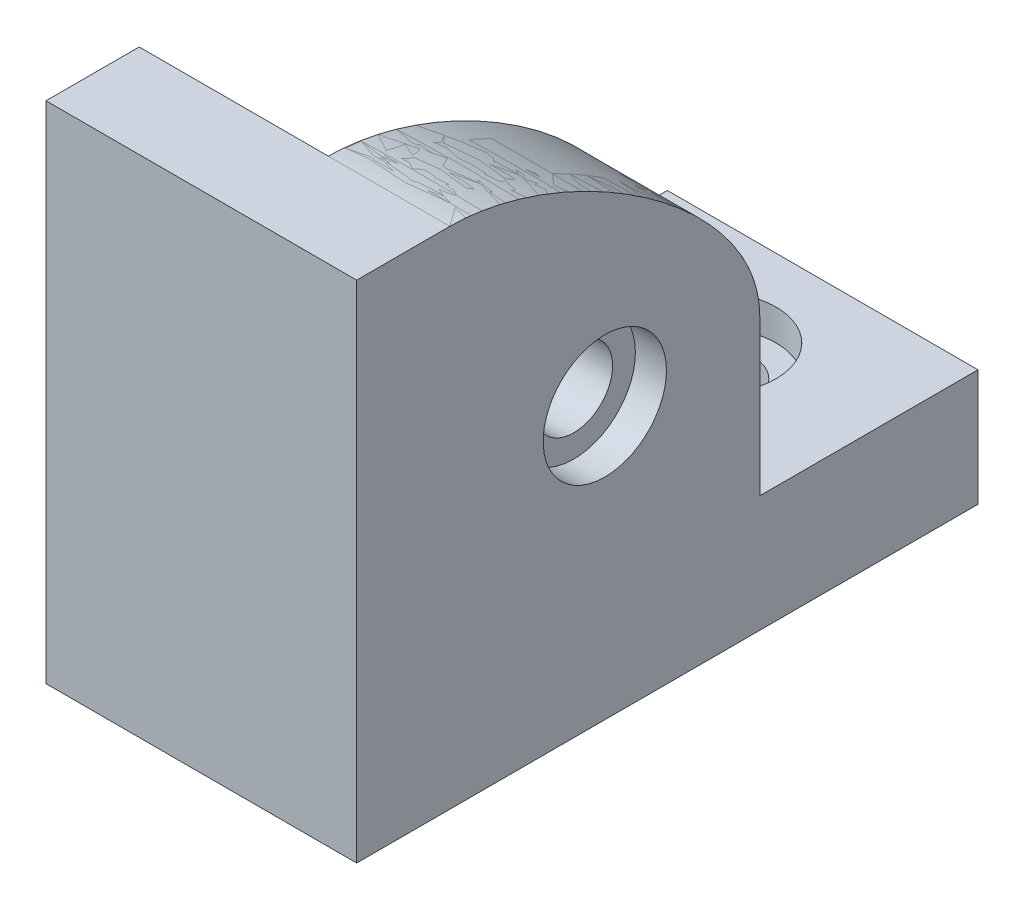
ISO-10303-21;
HEADER;
FILE_DESCRIPTION(('STEP AP214'),'2;1');
FILE_NAME('part.step','',(''),(''),'','','');
FILE_SCHEMA(('AUTOMOTIVE_DESIGN { 1 0 10303 214 1 1 1 1 }'));
ENDSEC;
DATA;
#1=APPLICATION_CONTEXT('core data for automotive mechanical design processes');
#2=APPLICATION_PROTOCOL_DEFINITION('international standard','automotive_design',2000,#1);
#3=PRODUCT_CONTEXT('',#1,'mechanical');
#4=PRODUCT('Part','Part','',(#3));
#5=PRODUCT_RELATED_PRODUCT_CATEGORY('part','',(#4));
#6=PRODUCT_DEFINITION_FORMATION('','',#4);
#7=PRODUCT_DEFINITION_CONTEXT('part definition',#1,'design');
#8=PRODUCT_DEFINITION('design','',#6,#7);
#9=PRODUCT_DEFINITION_SHAPE('','',#8);
#10=(LENGTH_UNIT() NAMED_UNIT(*) SI_UNIT(.MILLI.,.METRE.));
#11=(NAMED_UNIT(*) PLANE_ANGLE_UNIT() SI_UNIT($,.RADIAN.));
#12=(NAMED_UNIT(*) SI_UNIT($,.STERADIAN.) SOLID_ANGLE_UNIT());
#13=UNCERTAINTY_MEASURE_WITH_UNIT(LENGTH_MEASURE(1.E-05),#10,'distance_accuracy_value','');
#14=(GEOMETRIC_REPRESENTATION_CONTEXT(3) GLOBAL_UNCERTAINTY_ASSIGNED_CONTEXT((#13)) GLOBAL_UNIT_ASSIGNED_CONTEXT((#10,
#11,#12)) REPRESENTATION_CONTEXT('',''));
#15=CARTESIAN_POINT('',(0.,0.,0.));
#16=DIRECTION('',(0.,0.,1.));
#17=DIRECTION('',(1.,0.,0.));
#18=AXIS2_PLACEMENT_3D('',#15,#16,#17);
#19=CARTESIAN_POINT('',(5.46874999999998,17.5,-11.4203460586659));
#20=CARTESIAN_POINT('',(5.46874999999998,24.4922587484551,-11.4203460586659));
#21=CARTESIAN_POINT('',(5.46874999999998,32.5,0.878778443722737));
#22=CARTESIAN_POINT('',(5.46874999999998,32.5,8.53125000000001));
#23=CARTESIAN_POINT('',(4.80208333333332,17.5,-11.4203460586659));
#24=CARTESIAN_POINT('',(4.80208333333332,24.4922603521849,-11.4203460586659));
#25=CARTESIAN_POINT('',(4.81736452311698,32.5,0.878776839992983));
#26=CARTESIAN_POINT('',(4.81736452311697,32.5,8.53125000000001));
#27=CARTESIAN_POINT('',(3.46874999999998,17.5,-11.4203460586659));
#28=CARTESIAN_POINT('',(3.46874999999998,24.4922635596444,-11.4203460586659));
#29=CARTESIAN_POINT('',(3.51459356935097,32.5,0.878773632533474));
#30=CARTESIAN_POINT('',(3.51459356935096,32.5,8.53125000000001));
#31=CARTESIAN_POINT('',(1.46874999999998,17.5,-11.4203460586659));
#32=CARTESIAN_POINT('',(1.46874999999998,24.4922900210575,-11.4203460586659));
#33=CARTESIAN_POINT('',(1.56043713870191,32.5,0.87874717112037));
#34=CARTESIAN_POINT('',(1.56043713870194,32.5,8.53125));
#35=CARTESIAN_POINT('',(-0.531250000000016,17.5,-11.4203460586659));
#36=CARTESIAN_POINT('',(-0.531250000000016,24.4923309157828,-11.4203460586659));
#37=CARTESIAN_POINT('',(-0.393719291947067,32.5,0.878706276395059));
#38=CARTESIAN_POINT('',(-0.393719291947075,32.5,8.53125000000001));
#39=CARTESIAN_POINT('',(-1.86458333333335,17.5,-11.4203460586659));
#40=CARTESIAN_POINT('',(-1.86458333333335,24.492372611734,-11.4203460586659));
#41=CARTESIAN_POINT('',(-1.69649024571308,32.5,0.878664580443857));
#42=CARTESIAN_POINT('',(-1.69649024571309,32.5,8.53125000000001));
#43=CARTESIAN_POINT('',(-2.53125000000002,17.5,-11.4203460586659));
#44=CARTESIAN_POINT('',(-2.53125000000002,24.4923934597096,-11.4203460586659));
#45=CARTESIAN_POINT('',(-2.34787572259609,32.5,0.878643732468255));
#46=CARTESIAN_POINT('',(-2.34787572259609,32.5,8.53125000000001));
#47=B_SPLINE_SURFACE_WITH_KNOTS('',3,3,((#19,#20,#21,#22),(#23,#24,#25,#26),(#27,#28,#29,#30),
(#31,#32,#33,#34),(#35,#36,#37,#38),(#39,#40,#41,#42),(#43,#44,#45,#46)),.UNSPECIFIED.,.F.,.F.,
.F.,(4,1,1,1,4),(4,4),(0.,0.25,0.5,0.75,1.),(0.,1.),.UNSPECIFIED.);
#48=DIRECTION('',(-1.,0.,0.));
#49=VECTOR('',#48,1.);
#50=CARTESIAN_POINT('',(1.46874999999998,17.5,-11.4203460586659));
#51=LINE('',#50,#49);
#52=CARTESIAN_POINT('',(5.46874999999998,17.5,-11.4203460586659));
#53=VERTEX_POINT('',#52);
#54=CARTESIAN_POINT('',(-2.53125000000002,17.5,-11.4203460586659));
#55=VERTEX_POINT('',#54);
#56=EDGE_CURVE('E13',#53,#55,#51,.T.);
#57=CARTESIAN_POINT('',(-2.53125000000002,17.5,-11.4203460586659));
#58=CARTESIAN_POINT('',(-2.53125000000002,24.4923934597096,-11.4203460586659));
#59=CARTESIAN_POINT('',(-2.34787572259609,32.5,0.878643732468255));
#60=CARTESIAN_POINT('',(-2.34787572259609,32.5,8.53125000000001));
#61=B_SPLINE_CURVE_WITH_KNOTS('',3,(#57,#58,#59,#60),.UNSPECIFIED.,.F.,.F.,(4,4),(0.,1.),.UNSPECIFIED.);
#62=CARTESIAN_POINT('',(-2.34787572259609,32.5,8.53125000000001));
#63=VERTEX_POINT('',#62);
#64=EDGE_CURVE('E118',#55,#63,#61,.T.);
#65=DIRECTION('',(-1.,0.,0.));
#66=VECTOR('',#65,1.);
#67=CARTESIAN_POINT('',(1.56043713870194,32.5,8.53125));
#68=LINE('',#67,#66);
#69=CARTESIAN_POINT('',(5.46874999999998,32.5,8.53125000000001));
#70=VERTEX_POINT('',#69);
#71=EDGE_CURVE('E112',#70,#63,#68,.T.);
#72=CARTESIAN_POINT('',(5.46874999999998,17.5,-11.4203460586659));
#73=CARTESIAN_POINT('',(5.46874999999998,24.4922587484551,-11.4203460586659));
#74=CARTESIAN_POINT('',(5.46874999999998,32.5,0.878778443722737));
#75=CARTESIAN_POINT('',(5.46874999999998,32.5,8.53125000000001));
#76=B_SPLINE_CURVE_WITH_KNOTS('',3,(#72,#73,#74,#75),.UNSPECIFIED.,.F.,.F.,(4,4),(0.,1.),.UNSPECIFIED.);
#77=EDGE_CURVE('E131',#53,#70,#76,.T.);
#78=ORIENTED_EDGE('',*,*,#56,.T.);
#79=ORIENTED_EDGE('',*,*,#64,.T.);
#80=ORIENTED_EDGE('',*,*,#71,.F.);
#81=ORIENTED_EDGE('',*,*,#77,.F.);
#82=EDGE_LOOP('',(#78,#79,#80,#81));
#83=FACE_BOUND('',#82,.T.);
#84=ADVANCED_FACE('F109',(#83),#47,.T.);
#85=OPEN_SHELL('',(#84));
#86=SHELL_BASED_SURFACE_MODEL('B2',(#85));
#87=CARTESIAN_POINT('',(7.46874999999998,17.5,-1.44454802933295));
#88=DIRECTION('',(-1.,0.,0.));
#89=DIRECTION('',(0.,0.,1.));
#90=AXIS2_PLACEMENT_3D('',#87,#88,#89);
#91=CYLINDRICAL_SURFACE('',#90,2.5);
#92=CARTESIAN_POINT('',(-2.53125000000002,17.5,-1.44454802933295));
#93=DIRECTION('',(-1.,0.,0.));
#94=DIRECTION('',(0.,0.,1.));
#95=AXIS2_PLACEMENT_3D('',#92,#93,#94);
#96=CIRCLE('',#95,2.5);
#97=CARTESIAN_POINT('',(-2.53125000000002,17.5,-3.94454802933295));
#98=VERTEX_POINT('',#97);
#99=CARTESIAN_POINT('',(-2.53125000000002,17.5,1.05545197066705));
#100=VERTEX_POINT('',#99);
#101=EDGE_CURVE('E189',#98,#100,#96,.T.);
#102=ORIENTED_EDGE('',*,*,#101,.T.);
#103=CARTESIAN_POINT('',(-2.53125000000002,17.5,-3.94454802933295));
#104=CARTESIAN_POINT('',(-2.53072860302079,17.5703168114299,-3.94455476533739));
#105=CARTESIAN_POINT('',(-2.53020266211358,17.6406303926544,-3.94158138086595));
#106=CARTESIAN_POINT('',(-2.52914363108943,17.7807544209254,-3.92972651991399));
#107=CARTESIAN_POINT('',(-2.52861054131617,17.8505648919129,-3.92084532646593));
#108=CARTESIAN_POINT('',(-2.52753947737424,17.9891441455059,-3.89723528635993));
#109=CARTESIAN_POINT('',(-2.52700150690149,18.0579136257029,-3.8825105536597));
#110=CARTESIAN_POINT('',(-2.52592306686837,18.1939508371622,-3.84733290251047));
#111=CARTESIAN_POINT('',(-2.52538259733843,18.261218586649,-3.82688005361656));
#112=CARTESIAN_POINT('',(-2.52376114645402,18.4601179771052,-3.75709529449122));
#113=CARTESIAN_POINT('',(-2.52267967075456,18.5889044584542,-3.69932711781762));
#114=CARTESIAN_POINT('',(-2.52054714773739,18.8348534618292,-3.56302831265839));
#115=CARTESIAN_POINT('',(-2.51949609448815,18.9520182607176,-3.48450176214335));
#116=CARTESIAN_POINT('',(-2.51745770773856,19.1715244182749,-3.30888438973982));
#117=CARTESIAN_POINT('',(-2.5164703755734,19.2738654663903,-3.21179317902578));
#118=CARTESIAN_POINT('',(-2.51459688634019,19.4608050674248,-3.00179321737231));
#119=CARTESIAN_POINT('',(-2.5137107446932,19.5454009176826,-2.88888206135653));
#120=CARTESIAN_POINT('',(-2.51207783702964,19.6944302665532,-2.6504652173711));
#121=CARTESIAN_POINT('',(-2.51133106200813,19.7588650680183,-2.52496034392831));
#122=CARTESIAN_POINT('',(-2.51001289402045,19.8657445814045,-2.26492123408137));
#123=CARTESIAN_POINT('',(-2.50944148980044,19.9081907044945,-2.13038757774416));
#124=CARTESIAN_POINT('',(-2.50850549665141,19.9698946809412,-1.85610675518429));
#125=CARTESIAN_POINT('',(-2.50814090383561,19.9891529700929,-1.71635968699402));
#126=CARTESIAN_POINT('',(-2.50764328937251,20.0039321189962,-1.43560761947645));
#127=CARTESIAN_POINT('',(-2.50751027299217,19.9994524388617,-1.29460259161147));
#128=CARTESIAN_POINT('',(-2.50749183982671,19.9668959136227,-1.01536995638766));
#129=CARTESIAN_POINT('',(-2.50760641103917,19.9388202124347,-0.877142214720806));
#130=CARTESIAN_POINT('',(-2.50808977343197,19.8598195561542,-0.607298593889331));
#131=CARTESIAN_POINT('',(-2.50845856377565,19.8088946762603,-0.475682692966207));
#132=CARTESIAN_POINT('',(-2.50919793457815,19.7165657447936,-0.286187091936605));
#133=CARTESIAN_POINT('',(-2.50947561152868,19.6831113699531,-0.224313745568576));
#134=CARTESIAN_POINT('',(-2.51009147366542,19.6111120231501,-0.103601832609836));
#135=CARTESIAN_POINT('',(-2.51042964483067,19.5725682313203,-0.0447625668621468));
#136=CARTESIAN_POINT('',(-2.51116414901237,19.4906766124489,0.0694340589957167));
#137=CARTESIAN_POINT('',(-2.51156045779159,19.4473307891799,0.124792856419113));
#138=CARTESIAN_POINT('',(-2.51240864130402,19.3561027179078,0.231707112213782));
#139=CARTESIAN_POINT('',(-2.51286056928039,19.3082161333443,0.283258849447767));
#140=CARTESIAN_POINT('',(-2.51429377640519,19.1583423872952,0.431512669147167));
#141=CARTESIAN_POINT('',(-2.51535344645691,19.0500335367565,0.521963232033607));
#142=CARTESIAN_POINT('',(-2.5176454594551,18.8197563418269,0.683364484733246));
#143=CARTESIAN_POINT('',(-2.51887779592281,18.6977885099814,0.75431590589559));
#144=CARTESIAN_POINT('',(-2.52082227203037,18.507257864124,0.844644420869296));
#145=CARTESIAN_POINT('',(-2.52148718808901,18.4424111280201,0.872091517141277));
#146=CARTESIAN_POINT('',(-2.52284272518149,18.310671876923,0.921407857485457));
#147=CARTESIAN_POINT('',(-2.52353332487184,18.2437810684808,0.943281619421594));
#148=CARTESIAN_POINT('',(-2.52493346456916,18.1084666889405,0.981293062803098));
#149=CARTESIAN_POINT('',(-2.52564298531421,18.0400446872394,0.997436355027009));
#150=CARTESIAN_POINT('',(-2.52707491834826,17.9020969382961,1.02390230831038));
#151=CARTESIAN_POINT('',(-2.52779732679878,17.8325715203554,1.03422667358182));
#152=CARTESIAN_POINT('',(-2.52897636598023,17.719079100866,1.04622169804947));
#153=CARTESIAN_POINT('',(-2.52943118925927,17.675293668189,1.04968525300246));
#154=CARTESIAN_POINT('',(-2.53034081728835,17.5876736993652,1.05429871652356));
#155=CARTESIAN_POINT('',(-2.5307956208257,17.5438393640991,1.05545244095135));
#156=CARTESIAN_POINT('',(-2.53125000000002,17.5,1.0554519706676));
#157=B_SPLINE_CURVE_WITH_KNOTS('',3,(#103,#104,#105,#106,#107,#108,#109,#110,#111,#112,#113,
#114,#115,#116,#117,#118,#119,#120,#121,#122,#123,#124,#125,#126,#127,#128,#129,#130,#131,#132,
#133,#134,#135,#136,#137,#138,#139,#140,#141,#142,#143,#144,#145,#146,#147,#148,#149,#150,#151,
#152,#153,#154,#155,#156),.UNSPECIFIED.,.F.,.F.,(4,2,2,2,2,2,2,2,2,2,2,2,2,2,2,2,2,2,2,2,2,2,2,
2,2,2,4),(0.,0.210887626755834,0.421765150993223,0.632494476250965,0.843221242785776,
1.26449836183744,1.68569278266523,2.10689602612149,2.52816337393263,2.9494034928756,
3.3706165745107,3.79182173969187,4.21303648462138,4.63423081056959,5.05542375034402,
5.26623529610221,5.47699804450008,5.68767317557845,5.89855157387015,6.31976175806819,
6.74095614189066,6.9520049279565,7.16288208513938,7.3735521964798,7.58416057593354,
7.71587834108512,7.8473783272208),.UNSPECIFIED.);
#158=EDGE_CURVE('E107',#98,#100,#157,.T.);
#159=ORIENTED_EDGE('',*,*,#158,.F.);
#160=EDGE_LOOP('',(#102,#159));
#161=FACE_BOUND('',#160,.T.);
#162=CARTESIAN_POINT('',(3.46874999999998,17.5,-1.44454802933295));
#163=DIRECTION('',(1.,0.,0.));
#164=DIRECTION('',(0.,0.,-1.));
#165=AXIS2_PLACEMENT_3D('',#162,#163,#164);
#166=CIRCLE('',#165,2.5);
#167=CARTESIAN_POINT('',(3.46874999999998,17.5,-3.94454802933295));
#168=VERTEX_POINT('',#167);
#169=EDGE_CURVE('E177',#168,#168,#166,.F.);
#170=ORIENTED_EDGE('',*,*,#169,.F.);
#171=EDGE_LOOP('',(#170));
#172=FACE_BOUND('',#171,.T.);
#173=ADVANCED_FACE('F173',(#161,#172),#91,.F.);
#174=CARTESIAN_POINT('',(-4.53125000000002,-2.5,-18.46875));
#175=DIRECTION('',(0.,1.,0.));
#176=DIRECTION('',(0.,0.,1.));
#177=AXIS2_PLACEMENT_3D('',#174,#175,#176);
#178=CYLINDRICAL_SURFACE('',#177,2.5);
#179=CARTESIAN_POINT('',(-4.53125000000002,0.,-18.46875));
#180=DIRECTION('',(0.,1.,0.));
#181=DIRECTION('',(0.,0.,1.));
#182=AXIS2_PLACEMENT_3D('',#179,#180,#181);
#183=CIRCLE('',#182,2.5);
#184=CARTESIAN_POINT('',(-4.53125000000002,0.,-15.96875));
#185=VERTEX_POINT('',#184);
#186=EDGE_CURVE('E397',#185,#185,#183,.T.);
#187=ORIENTED_EDGE('',*,*,#186,.F.);
#188=EDGE_LOOP('',(#187));
#189=FACE_BOUND('',#188,.T.);
#190=CARTESIAN_POINT('',(-4.53125000000002,5.5,-18.46875));
#191=DIRECTION('',(0.,1.,0.));
#192=DIRECTION('',(0.,0.,1.));
#193=AXIS2_PLACEMENT_3D('',#190,#191,#192);
#194=CIRCLE('',#193,2.5);
#195=CARTESIAN_POINT('',(-4.53125000000002,5.5,-15.96875));
#196=VERTEX_POINT('',#195);
#197=EDGE_CURVE('E389',#196,#196,#194,.F.);
#198=ORIENTED_EDGE('',*,*,#197,.F.);
#199=EDGE_LOOP('',(#198));
#200=FACE_BOUND('',#199,.T.);
#201=ADVANCED_FACE('F338',(#189,#200),#178,.F.);
#202=CARTESIAN_POINT('',(-8.53125000000002,-2.5,0.));
#203=DIRECTION('',(0.,1.,0.));
#204=DIRECTION('',(0.,0.,1.));
#205=AXIS2_PLACEMENT_3D('',#202,#203,#204);
#206=CYLINDRICAL_SURFACE('',#205,2.5);
#207=CARTESIAN_POINT('',(-8.53125000000002,0.,0.));
#208=DIRECTION('',(0.,1.,0.));
#209=DIRECTION('',(0.,0.,1.));
#210=AXIS2_PLACEMENT_3D('',#207,#208,#209);
#211=CIRCLE('',#210,2.5);
#212=CARTESIAN_POINT('',(-8.53125000000002,0.,2.5));
#213=VERTEX_POINT('',#212);
#214=EDGE_CURVE('E258',#213,#213,#211,.T.);
#215=ORIENTED_EDGE('',*,*,#214,.F.);
#216=EDGE_LOOP('',(#215));
#217=FACE_BOUND('',#216,.T.);
#218=CARTESIAN_POINT('',(-8.53125000000002,5.5,0.));
#219=DIRECTION('',(0.,1.,0.));
#220=DIRECTION('',(0.,0.,1.));
#221=AXIS2_PLACEMENT_3D('',#218,#219,#220);
#222=CIRCLE('',#221,2.5);
#223=CARTESIAN_POINT('',(-8.53125000000002,5.5,2.5));
#224=VERTEX_POINT('',#223);
#225=EDGE_CURVE('E394',#224,#224,#222,.F.);
#226=ORIENTED_EDGE('',*,*,#225,.F.);
#227=EDGE_LOOP('',(#226));
#228=FACE_BOUND('',#227,.T.);
#229=ADVANCED_FACE('F339',(#217,#228),#206,.F.);
#230=CARTESIAN_POINT('',(0.,7.5,0.));
#231=DIRECTION('',(0.,1.,0.));
#232=DIRECTION('',(0.,0.,1.));
#233=AXIS2_PLACEMENT_3D('',#230,#231,#232);
#234=PLANE('',#233);
#235=CARTESIAN_POINT('',(-4.53125000000002,7.5,-18.46875));
#236=DIRECTION('',(0.,1.,0.));
#237=DIRECTION('',(0.,0.,1.));
#238=AXIS2_PLACEMENT_3D('',#235,#236,#237);
#239=CIRCLE('',#238,4.);
#240=CARTESIAN_POINT('',(-4.53125000000002,7.5,-14.46875));
#241=VERTEX_POINT('',#240);
#242=EDGE_CURVE('E379',#241,#241,#239,.T.);
#243=ORIENTED_EDGE('',*,*,#242,.F.);
#244=EDGE_LOOP('',(#243));
#245=FACE_BOUND('',#244,.T.);
#246=CARTESIAN_POINT('',(-8.53125000000002,7.5,0.));
#247=DIRECTION('',(0.,1.,0.));
#248=DIRECTION('',(0.,0.,1.));
#249=AXIS2_PLACEMENT_3D('',#246,#247,#248);
#250=CIRCLE('',#249,4.);
#251=CARTESIAN_POINT('',(-8.53125000000002,7.5,4.));
#252=VERTEX_POINT('',#251);
#253=EDGE_CURVE('E395',#252,#252,#250,.T.);
#254=ORIENTED_EDGE('',*,*,#253,.F.);
#255=EDGE_LOOP('',(#254));
#256=FACE_BOUND('',#255,.T.);
#257=DIRECTION('',(0.,0.,1.));
#258=VECTOR('',#257,1.);
#259=CARTESIAN_POINT('',(-2.53125000000002,7.5,8.57965394133409));
#260=LINE('',#259,#258);
#261=CARTESIAN_POINT('',(-2.53125000000002,7.5,-11.4203460586659));
#262=VERTEX_POINT('',#261);
#263=CARTESIAN_POINT('',(-2.53125000000002,7.5,8.53125000000001));
#264=VERTEX_POINT('',#263);
#265=EDGE_CURVE('E274',#262,#264,#260,.T.);
#266=ORIENTED_EDGE('',*,*,#265,.F.);
#267=DIRECTION('',(-1.,0.,0.));
#268=VECTOR('',#267,1.);
#269=CARTESIAN_POINT('',(5.46874999999998,7.5,-11.4203460586659));
#270=LINE('',#269,#268);
#271=CARTESIAN_POINT('',(5.46874999999998,7.5,-11.4203460586659));
#272=VERTEX_POINT('',#271);
#273=EDGE_CURVE('E272',#272,#262,#270,.T.);
#274=ORIENTED_EDGE('',*,*,#273,.F.);
#275=DIRECTION('',(0.,0.,-1.));
#276=VECTOR('',#275,1.);
#277=CARTESIAN_POINT('',(5.46874999999998,7.5,-25.46875));
#278=LINE('',#277,#276);
#279=CARTESIAN_POINT('',(5.46874999999998,7.5,-25.46875));
#280=VERTEX_POINT('',#279);
#281=EDGE_CURVE('E299',#272,#280,#278,.T.);
#282=ORIENTED_EDGE('',*,*,#281,.T.);
#283=DIRECTION('',(-1.,0.,0.));
#284=VECTOR('',#283,1.);
#285=CARTESIAN_POINT('',(-14.53125,7.5,-25.46875));
#286=LINE('',#285,#284);
#287=CARTESIAN_POINT('',(-14.53125,7.5,-25.46875));
#288=VERTEX_POINT('',#287);
#289=EDGE_CURVE('E302',#280,#288,#286,.T.);
#290=ORIENTED_EDGE('',*,*,#289,.T.);
#291=DIRECTION('',(0.,0.,1.));
#292=VECTOR('',#291,1.);
#293=CARTESIAN_POINT('',(-14.53125,7.5,-25.46875));
#294=LINE('',#293,#292);
#295=CARTESIAN_POINT('',(-14.53125,7.5,8.53125000000001));
#296=VERTEX_POINT('',#295);
#297=EDGE_CURVE('E296',#288,#296,#294,.T.);
#298=ORIENTED_EDGE('',*,*,#297,.T.);
#299=DIRECTION('',(-1.,0.,0.));
#300=VECTOR('',#299,1.);
#301=CARTESIAN_POINT('',(-14.53125,7.5,8.53125000000001));
#302=LINE('',#301,#300);
#303=EDGE_CURVE('E277',#264,#296,#302,.T.);
#304=ORIENTED_EDGE('',*,*,#303,.F.);
#305=EDGE_LOOP('',(#266,#274,#282,#290,#298,#304));
#306=FACE_BOUND('',#305,.T.);
#307=ADVANCED_FACE('F342',(#245,#256,#306),#234,.T.);
#308=CARTESIAN_POINT('',(-14.53125,32.5,8.53125000000001));
#309=DIRECTION('',(0.,0.,1.));
#310=DIRECTION('',(1.,0.,0.));
#311=AXIS2_PLACEMENT_3D('',#308,#309,#310);
#312=PLANE('',#311);
#313=DIRECTION('',(-1.,0.,0.));
#314=VECTOR('',#313,1.);
#315=CARTESIAN_POINT('',(-14.53125,32.5,8.53125000000001));
#316=LINE('',#315,#314);
#317=CARTESIAN_POINT('',(-2.34787572259609,32.5,8.53125));
#318=VERTEX_POINT('',#317);
#319=CARTESIAN_POINT('',(-14.53125,32.5,8.53125000000001));
#320=VERTEX_POINT('',#319);
#321=EDGE_CURVE('E287',#318,#320,#316,.T.);
#322=ORIENTED_EDGE('',*,*,#321,.F.);
#323=DIRECTION('',(-0.0122240384231617,-0.999925283651048,0.));
#324=VECTOR('',#323,1.);
#325=CARTESIAN_POINT('',(-2.43956286129806,25.,8.53125));
#326=LINE('',#325,#324);
#327=CARTESIAN_POINT('',(-2.53125000000002,17.5,8.53125000000001));
#328=VERTEX_POINT('',#327);
#329=EDGE_CURVE('E402',#318,#328,#326,.T.);
#330=ORIENTED_EDGE('',*,*,#329,.T.);
#331=DIRECTION('',(0.,1.,0.));
#332=VECTOR('',#331,1.);
#333=CARTESIAN_POINT('',(-2.53125000000002,32.5,8.53125000000001));
#334=LINE('',#333,#332);
#335=EDGE_CURVE('E182',#264,#328,#334,.T.);
#336=ORIENTED_EDGE('',*,*,#335,.F.);
#337=ORIENTED_EDGE('',*,*,#303,.T.);
#338=DIRECTION('',(0.,-1.,0.));
#339=VECTOR('',#338,1.);
#340=CARTESIAN_POINT('',(-14.53125,32.5,8.53125000000001));
#341=LINE('',#340,#339);
#342=EDGE_CURVE('E291',#320,#296,#341,.T.);
#343=ORIENTED_EDGE('',*,*,#342,.F.);
#344=EDGE_LOOP('',(#322,#330,#336,#337,#343));
#345=FACE_BOUND('',#344,.T.);
#346=ADVANCED_FACE('F414',(#345),#312,.F.);
#347=CARTESIAN_POINT('',(-14.53125,7.5,-25.46875));
#348=DIRECTION('',(1.,0.,0.));
#349=DIRECTION('',(0.,0.,-1.));
#350=AXIS2_PLACEMENT_3D('',#347,#348,#349);
#351=PLANE('',#350);
#352=DIRECTION('',(0.,0.,1.));
#353=VECTOR('',#352,1.);
#354=CARTESIAN_POINT('',(-14.53125,0.,-25.46875));
#355=LINE('',#354,#353);
#356=CARTESIAN_POINT('',(-14.53125,0.,-25.46875));
#357=VERTEX_POINT('',#356);
#358=CARTESIAN_POINT('',(-14.53125,0.,14.53125));
#359=VERTEX_POINT('',#358);
#360=EDGE_CURVE('E295',#357,#359,#355,.T.);
#361=ORIENTED_EDGE('',*,*,#360,.T.);
#362=DIRECTION('',(0.,-1.,0.));
#363=VECTOR('',#362,1.);
#364=CARTESIAN_POINT('',(-14.53125,7.5,14.53125));
#365=LINE('',#364,#363);
#366=CARTESIAN_POINT('',(-14.53125,32.5,14.53125));
#367=VERTEX_POINT('',#366);
#368=EDGE_CURVE('E320',#367,#359,#365,.T.);
#369=ORIENTED_EDGE('',*,*,#368,.F.);
#370=DIRECTION('',(0.,0.,1.));
#371=VECTOR('',#370,1.);
#372=CARTESIAN_POINT('',(-14.53125,32.5,8.53125000000001));
#373=LINE('',#372,#371);
#374=EDGE_CURVE('E278',#320,#367,#373,.T.);
#375=ORIENTED_EDGE('',*,*,#374,.F.);
#376=ORIENTED_EDGE('',*,*,#342,.T.);
#377=ORIENTED_EDGE('',*,*,#297,.F.);
#378=DIRECTION('',(0.,-1.,0.));
#379=VECTOR('',#378,1.);
#380=CARTESIAN_POINT('',(-14.53125,7.5,-25.46875));
#381=LINE('',#380,#379);
#382=EDGE_CURVE('E304',#288,#357,#381,.T.);
#383=ORIENTED_EDGE('',*,*,#382,.T.);
#384=EDGE_LOOP('',(#361,#369,#375,#376,#377,#383));
#385=FACE_BOUND('',#384,.T.);
#386=ADVANCED_FACE('F175',(#385),#351,.F.);
#387=CARTESIAN_POINT('',(-14.53125,7.5,14.53125));
#388=DIRECTION('',(0.,0.,-1.));
#389=DIRECTION('',(-1.,0.,0.));
#390=AXIS2_PLACEMENT_3D('',#387,#388,#389);
#391=PLANE('',#390);
#392=DIRECTION('',(1.,0.,0.));
#393=VECTOR('',#392,1.);
#394=CARTESIAN_POINT('',(-14.53125,0.,14.53125));
#395=LINE('',#394,#393);
#396=CARTESIAN_POINT('',(5.46874999999998,0.,14.53125));
#397=VERTEX_POINT('',#396);
#398=EDGE_CURVE('E307',#359,#397,#395,.T.);
#399=ORIENTED_EDGE('',*,*,#398,.T.);
#400=DIRECTION('',(0.,-1.,0.));
#401=VECTOR('',#400,1.);
#402=CARTESIAN_POINT('',(5.46874999999998,7.5,14.53125));
#403=LINE('',#402,#401);
#404=CARTESIAN_POINT('',(5.46874999999998,32.5,14.53125));
#405=VERTEX_POINT('',#404);
#406=EDGE_CURVE('E317',#405,#397,#403,.T.);
#407=ORIENTED_EDGE('',*,*,#406,.F.);
#408=DIRECTION('',(1.,0.,0.));
#409=VECTOR('',#408,1.);
#410=CARTESIAN_POINT('',(-14.53125,32.5,14.53125));
#411=LINE('',#410,#409);
#412=EDGE_CURVE('E281',#367,#405,#411,.T.);
#413=ORIENTED_EDGE('',*,*,#412,.F.);
#414=ORIENTED_EDGE('',*,*,#368,.T.);
#415=EDGE_LOOP('',(#399,#407,#413,#414));
#416=FACE_BOUND('',#415,.T.);
#417=ADVANCED_FACE('F447',(#416),#391,.F.);
#418=CARTESIAN_POINT('',(5.46874999999998,7.5,-25.46875));
#419=DIRECTION('',(-1.,0.,0.));
#420=DIRECTION('',(0.,0.,1.));
#421=AXIS2_PLACEMENT_3D('',#418,#419,#420);
#422=PLANE('',#421);
#423=CARTESIAN_POINT('',(5.46874999999998,17.5,-1.44454802933295));
#424=DIRECTION('',(1.,0.,0.));
#425=DIRECTION('',(0.,0.,-1.));
#426=AXIS2_PLACEMENT_3D('',#423,#424,#425);
#427=CIRCLE('',#426,3.96787612318494);
#428=CARTESIAN_POINT('',(5.46874999999998,17.5,-5.41242415251789));
#429=VERTEX_POINT('',#428);
#430=EDGE_CURVE('E383',#429,#429,#427,.T.);
#431=ORIENTED_EDGE('',*,*,#430,.F.);
#432=EDGE_LOOP('',(#431));
#433=FACE_BOUND('',#432,.T.);
#434=DIRECTION('',(0.,-1.,0.));
#435=VECTOR('',#434,1.);
#436=CARTESIAN_POINT('',(5.46874999999998,17.5,-11.4203460586659));
#437=LINE('',#436,#435);
#438=CARTESIAN_POINT('',(5.46874999999998,17.5,-11.4203460586659));
#439=VERTEX_POINT('',#438);
#440=EDGE_CURVE('E266',#439,#272,#437,.T.);
#441=ORIENTED_EDGE('',*,*,#440,.F.);
#442=CARTESIAN_POINT('',(5.46874999999998,32.5,8.53125000000001));
#443=CARTESIAN_POINT('',(5.46874999999998,32.5,0.878778443722737));
#444=CARTESIAN_POINT('',(5.46874999999998,24.4922587484551,-11.4203460586659));
#445=CARTESIAN_POINT('',(5.46874999999998,17.5,-11.4203460586659));
#446=B_SPLINE_CURVE_WITH_KNOTS('',3,(#442,#443,#444,#445),.UNSPECIFIED.,.F.,.F.,(4,4),(0.,1.),.UNSPECIFIED.);
#447=CARTESIAN_POINT('',(5.46874999999998,32.5,8.53125000000001));
#448=VERTEX_POINT('',#447);
#449=EDGE_CURVE('E257',#448,#439,#446,.T.);
#450=ORIENTED_EDGE('',*,*,#449,.F.);
#451=DIRECTION('',(0.,0.,-1.));
#452=VECTOR('',#451,1.);
#453=CARTESIAN_POINT('',(5.46874999999998,32.5,8.53125000000001));
#454=LINE('',#453,#452);
#455=EDGE_CURVE('E284',#405,#448,#454,.T.);
#456=ORIENTED_EDGE('',*,*,#455,.F.);
#457=ORIENTED_EDGE('',*,*,#406,.T.);
#458=DIRECTION('',(0.,0.,-1.));
#459=VECTOR('',#458,1.);
#460=CARTESIAN_POINT('',(5.46874999999998,0.,-25.46875));
#461=LINE('',#460,#459);
#462=CARTESIAN_POINT('',(5.46874999999998,0.,-25.46875));
#463=VERTEX_POINT('',#462);
#464=EDGE_CURVE('E309',#397,#463,#461,.T.);
#465=ORIENTED_EDGE('',*,*,#464,.T.);
#466=DIRECTION('',(0.,-1.,0.));
#467=VECTOR('',#466,1.);
#468=CARTESIAN_POINT('',(5.46874999999998,7.5,-25.46875));
#469=LINE('',#468,#467);
#470=EDGE_CURVE('E314',#280,#463,#469,.T.);
#471=ORIENTED_EDGE('',*,*,#470,.F.);
#472=ORIENTED_EDGE('',*,*,#281,.F.);
#473=EDGE_LOOP('',(#441,#450,#456,#457,#465,#471,#472));
#474=FACE_BOUND('',#473,.T.);
#475=ADVANCED_FACE('F435',(#433,#474),#422,.F.);
#476=CARTESIAN_POINT('',(-14.53125,7.5,-25.46875));
#477=DIRECTION('',(0.,0.,1.));
#478=DIRECTION('',(1.,0.,0.));
#479=AXIS2_PLACEMENT_3D('',#476,#477,#478);
#480=PLANE('',#479);
#481=DIRECTION('',(-1.,0.,0.));
#482=VECTOR('',#481,1.);
#483=CARTESIAN_POINT('',(-14.53125,0.,-25.46875));
#484=LINE('',#483,#482);
#485=EDGE_CURVE('E300',#463,#357,#484,.T.);
#486=ORIENTED_EDGE('',*,*,#485,.T.);
#487=ORIENTED_EDGE('',*,*,#382,.F.);
#488=ORIENTED_EDGE('',*,*,#289,.F.);
#489=ORIENTED_EDGE('',*,*,#470,.T.);
#490=EDGE_LOOP('',(#486,#487,#488,#489));
#491=FACE_BOUND('',#490,.T.);
#492=ADVANCED_FACE('F440',(#491),#480,.F.);
#493=CARTESIAN_POINT('',(0.,0.,0.));
#494=DIRECTION('',(0.,1.,0.));
#495=DIRECTION('',(0.,0.,1.));
#496=AXIS2_PLACEMENT_3D('',#493,#494,#495);
#497=PLANE('',#496);
#498=ORIENTED_EDGE('',*,*,#186,.T.);
#499=EDGE_LOOP('',(#498));
#500=FACE_BOUND('',#499,.T.);
#501=ORIENTED_EDGE('',*,*,#214,.T.);
#502=EDGE_LOOP('',(#501));
#503=FACE_BOUND('',#502,.T.);
#504=ORIENTED_EDGE('',*,*,#360,.F.);
#505=ORIENTED_EDGE('',*,*,#485,.F.);
#506=ORIENTED_EDGE('',*,*,#464,.F.);
#507=ORIENTED_EDGE('',*,*,#398,.F.);
#508=EDGE_LOOP('',(#504,#505,#506,#507));
#509=FACE_BOUND('',#508,.T.);
#510=ADVANCED_FACE('F444',(#500,#503,#509),#497,.F.);
#511=CARTESIAN_POINT('',(0.,32.5,0.));
#512=DIRECTION('',(0.,1.,0.));
#513=DIRECTION('',(0.,0.,1.));
#514=AXIS2_PLACEMENT_3D('',#511,#512,#513);
#515=PLANE('',#514);
#516=ORIENTED_EDGE('',*,*,#374,.T.);
#517=ORIENTED_EDGE('',*,*,#412,.T.);
#518=ORIENTED_EDGE('',*,*,#455,.T.);
#519=EDGE_CURVE('E288',#448,#318,#316,.T.);
#520=ORIENTED_EDGE('',*,*,#519,.T.);
#521=ORIENTED_EDGE('',*,*,#321,.T.);
#522=EDGE_LOOP('',(#516,#517,#518,#520,#521));
#523=FACE_BOUND('',#522,.T.);
#524=ADVANCED_FACE('F426',(#523),#515,.T.);
#525=CARTESIAN_POINT('',(-2.53125000000002,17.5,8.57965394133409));
#526=DIRECTION('',(1.,0.,0.));
#527=DIRECTION('',(0.,0.,-1.));
#528=AXIS2_PLACEMENT_3D('',#525,#526,#527);
#529=PLANE('',#528);
#530=DIRECTION('',(0.,0.,1.));
#531=VECTOR('',#530,1.);
#532=CARTESIAN_POINT('',(-2.53125000000002,17.5,8.57965394133409));
#533=LINE('',#532,#531);
#534=EDGE_CURVE('E195',#100,#328,#533,.T.);
#535=ORIENTED_EDGE('',*,*,#534,.F.);
#536=ORIENTED_EDGE('',*,*,#101,.F.);
#537=CARTESIAN_POINT('',(-2.53125000000002,17.5,-11.4203460586659));
#538=VERTEX_POINT('',#537);
#539=EDGE_CURVE('E255',#538,#98,#533,.T.);
#540=ORIENTED_EDGE('',*,*,#539,.F.);
#541=DIRECTION('',(0.,-1.,0.));
#542=VECTOR('',#541,1.);
#543=CARTESIAN_POINT('',(-2.53125000000002,17.5,-11.4203460586659));
#544=LINE('',#543,#542);
#545=EDGE_CURVE('E264',#538,#262,#544,.T.);
#546=ORIENTED_EDGE('',*,*,#545,.T.);
#547=ORIENTED_EDGE('',*,*,#265,.T.);
#548=ORIENTED_EDGE('',*,*,#335,.T.);
#549=EDGE_LOOP('',(#535,#536,#540,#546,#547,#548));
#550=FACE_BOUND('',#549,.T.);
#551=ADVANCED_FACE('F253',(#550),#529,.F.);
#552=CARTESIAN_POINT('',(5.46874999999998,17.5,-11.4203460586659));
#553=DIRECTION('',(0.,0.,1.));
#554=DIRECTION('',(1.,0.,0.));
#555=AXIS2_PLACEMENT_3D('',#552,#553,#554);
#556=PLANE('',#555);
#557=ORIENTED_EDGE('',*,*,#273,.T.);
#558=ORIENTED_EDGE('',*,*,#545,.F.);
#559=DIRECTION('',(-1.,0.,0.));
#560=VECTOR('',#559,1.);
#561=CARTESIAN_POINT('',(5.46874999999998,17.5,-11.4203460586659));
#562=LINE('',#561,#560);
#563=EDGE_CURVE('E268',#439,#538,#562,.T.);
#564=ORIENTED_EDGE('',*,*,#563,.F.);
#565=ORIENTED_EDGE('',*,*,#440,.T.);
#566=EDGE_LOOP('',(#557,#558,#564,#565));
#567=FACE_BOUND('',#566,.T.);
#568=ADVANCED_FACE('F433',(#567),#556,.F.);
#569=CARTESIAN_POINT('',(-2.53125000000002,17.5,-11.4203460586659));
#570=CARTESIAN_POINT('',(-2.53125000000002,17.5,-11.4203460586659));
#571=CARTESIAN_POINT('',(-2.53125000000002,24.4923934597096,-11.4203460586659));
#572=CARTESIAN_POINT('',(-2.53125000000002,17.5,-4.76981403911061));
#573=CARTESIAN_POINT('',(-2.34787572259609,32.5,0.878643732468255));
#574=CARTESIAN_POINT('',(-2.53125000000002,17.5,1.8807179804447));
#575=CARTESIAN_POINT('',(-2.34787572259609,32.5,8.53125000000001));
#576=CARTESIAN_POINT('',(-2.53125000000002,17.5,8.53125));
#577=B_SPLINE_SURFACE_WITH_KNOTS('',3,1,((#569,#570),(#571,#572),(#573,#574),(#575,#576)),
.UNSPECIFIED.,.F.,.F.,.F.,(4,4),(2,2),(0.,1.),(0.,1.),.UNSPECIFIED.);
#578=CARTESIAN_POINT('',(-2.53125000000002,17.5,-11.4203460586659));
#579=CARTESIAN_POINT('',(-2.53125000000002,24.4923934597096,-11.4203460586659));
#580=CARTESIAN_POINT('',(-2.34787572259609,32.5,0.878643732468255));
#581=CARTESIAN_POINT('',(-2.34787572259609,32.5,8.53125000000001));
#582=B_SPLINE_CURVE_WITH_KNOTS('',3,(#578,#579,#580,#581),.UNSPECIFIED.,.F.,.F.,(4,4),(0.,1.),.UNSPECIFIED.);
#583=EDGE_CURVE('E262',#538,#318,#582,.T.);
#584=ORIENTED_EDGE('',*,*,#539,.T.);
#585=ORIENTED_EDGE('',*,*,#158,.T.);
#586=ORIENTED_EDGE('',*,*,#534,.T.);
#587=ORIENTED_EDGE('',*,*,#329,.F.);
#588=ORIENTED_EDGE('',*,*,#583,.F.);
#589=EDGE_LOOP('',(#584,#585,#586,#587,#588));
#590=FACE_BOUND('',#589,.T.);
#591=ADVANCED_FACE('F261',(#590),#577,.F.);
#592=CARTESIAN_POINT('',(5.46874999999998,17.5,-11.4203460586659));
#593=CARTESIAN_POINT('',(5.46874999999998,24.4922587484551,-11.4203460586659));
#594=CARTESIAN_POINT('',(5.46874999999998,32.5,0.878778443722737));
#595=CARTESIAN_POINT('',(5.46874999999998,32.5,8.53125000000001));
#596=CARTESIAN_POINT('',(4.80208333333332,17.5,-11.4203460586659));
#597=CARTESIAN_POINT('',(4.80208333333332,24.4922603521849,-11.4203460586659));
#598=CARTESIAN_POINT('',(4.81736452311698,32.5,0.878776839992983));
#599=CARTESIAN_POINT('',(4.81736452311697,32.5,8.53125000000001));
#600=CARTESIAN_POINT('',(3.46874999999998,17.5,-11.4203460586659));
#601=CARTESIAN_POINT('',(3.46874999999998,24.4922635596444,-11.4203460586659));
#602=CARTESIAN_POINT('',(3.51459356935097,32.5,0.878773632533474));
#603=CARTESIAN_POINT('',(3.51459356935096,32.5,8.53125000000001));
#604=CARTESIAN_POINT('',(1.46874999999998,17.5,-11.4203460586659));
#605=CARTESIAN_POINT('',(1.46874999999998,24.4922900210575,-11.4203460586659));
#606=CARTESIAN_POINT('',(1.56043713870191,32.5,0.87874717112037));
#607=CARTESIAN_POINT('',(1.56043713870194,32.5,8.53125));
#608=CARTESIAN_POINT('',(-0.531250000000016,17.5,-11.4203460586659));
#609=CARTESIAN_POINT('',(-0.531250000000016,24.4923309157828,-11.4203460586659));
#610=CARTESIAN_POINT('',(-0.393719291947067,32.5,0.878706276395059));
#611=CARTESIAN_POINT('',(-0.393719291947075,32.5,8.53125000000001));
#612=CARTESIAN_POINT('',(-1.86458333333335,17.5,-11.4203460586659));
#613=CARTESIAN_POINT('',(-1.86458333333335,24.492372611734,-11.4203460586659));
#614=CARTESIAN_POINT('',(-1.69649024571308,32.5,0.878664580443857));
#615=CARTESIAN_POINT('',(-1.69649024571309,32.5,8.53125000000001));
#616=CARTESIAN_POINT('',(-2.53125000000002,17.5,-11.4203460586659));
#617=CARTESIAN_POINT('',(-2.53125000000002,24.4923934597096,-11.4203460586659));
#618=CARTESIAN_POINT('',(-2.34787572259609,32.5,0.878643732468255));
#619=CARTESIAN_POINT('',(-2.34787572259609,32.5,8.53125000000001));
#620=B_SPLINE_SURFACE_WITH_KNOTS('',3,3,((#592,#593,#594,#595),(#596,#597,#598,#599),(#600,#601,
#602,#603),(#604,#605,#606,#607),(#608,#609,#610,#611),(#612,#613,#614,#615),(#616,#617,#618,
#619)),.UNSPECIFIED.,.F.,.F.,.F.,(4,1,1,1,4),(4,4),(0.,0.25,0.5,0.75,1.),(0.,1.),.UNSPECIFIED.);
#621=ORIENTED_EDGE('',*,*,#449,.T.);
#622=ORIENTED_EDGE('',*,*,#563,.T.);
#623=ORIENTED_EDGE('',*,*,#583,.T.);
#624=ORIENTED_EDGE('',*,*,#519,.F.);
#625=EDGE_LOOP('',(#621,#622,#623,#624));
#626=FACE_BOUND('',#625,.T.);
#627=ADVANCED_FACE('F352',(#626),#620,.T.);
#628=CARTESIAN_POINT('',(-8.53125000000002,5.5,0.));
#629=DIRECTION('',(0.,1.,0.));
#630=DIRECTION('',(0.,0.,1.));
#631=AXIS2_PLACEMENT_3D('',#628,#629,#630);
#632=PLANE('',#631);
#633=CARTESIAN_POINT('',(-8.53125000000002,5.5,0.));
#634=DIRECTION('',(0.,1.,0.));
#635=DIRECTION('',(0.,0.,1.));
#636=AXIS2_PLACEMENT_3D('',#633,#634,#635);
#637=CIRCLE('',#636,4.);
#638=CARTESIAN_POINT('',(-8.53125000000002,5.5,4.));
#639=VERTEX_POINT('',#638);
#640=EDGE_CURVE('E391',#639,#639,#637,.T.);
#641=ORIENTED_EDGE('',*,*,#640,.T.);
#642=EDGE_LOOP('',(#641));
#643=FACE_BOUND('',#642,.T.);
#644=ORIENTED_EDGE('',*,*,#225,.T.);
#645=EDGE_LOOP('',(#644));
#646=FACE_BOUND('',#645,.T.);
#647=ADVANCED_FACE('F348',(#643,#646),#632,.T.);
#648=CARTESIAN_POINT('',(-8.53125000000002,5.5,0.));
#649=DIRECTION('',(0.,1.,0.));
#650=DIRECTION('',(0.,0.,1.));
#651=AXIS2_PLACEMENT_3D('',#648,#649,#650);
#652=CYLINDRICAL_SURFACE('',#651,4.);
#653=ORIENTED_EDGE('',*,*,#640,.F.);
#654=EDGE_LOOP('',(#653));
#655=FACE_BOUND('',#654,.T.);
#656=ORIENTED_EDGE('',*,*,#253,.T.);
#657=EDGE_LOOP('',(#656));
#658=FACE_BOUND('',#657,.T.);
#659=ADVANCED_FACE('F344',(#655,#658),#652,.F.);
#660=CARTESIAN_POINT('',(-4.53125000000002,5.5,-18.46875));
#661=DIRECTION('',(0.,1.,0.));
#662=DIRECTION('',(0.,0.,1.));
#663=AXIS2_PLACEMENT_3D('',#660,#661,#662);
#664=PLANE('',#663);
#665=CARTESIAN_POINT('',(-4.53125000000002,5.5,-18.46875));
#666=DIRECTION('',(0.,1.,0.));
#667=DIRECTION('',(0.,0.,1.));
#668=AXIS2_PLACEMENT_3D('',#665,#666,#667);
#669=CIRCLE('',#668,4.);
#670=CARTESIAN_POINT('',(-4.53125000000002,5.5,-14.46875));
#671=VERTEX_POINT('',#670);
#672=EDGE_CURVE('E381',#671,#671,#669,.T.);
#673=ORIENTED_EDGE('',*,*,#672,.T.);
#674=EDGE_LOOP('',(#673));
#675=FACE_BOUND('',#674,.T.);
#676=ORIENTED_EDGE('',*,*,#197,.T.);
#677=EDGE_LOOP('',(#676));
#678=FACE_BOUND('',#677,.T.);
#679=ADVANCED_FACE('F347',(#675,#678),#664,.T.);
#680=CARTESIAN_POINT('',(-4.53125000000002,5.5,-18.46875));
#681=DIRECTION('',(0.,1.,0.));
#682=DIRECTION('',(0.,0.,1.));
#683=AXIS2_PLACEMENT_3D('',#680,#681,#682);
#684=CYLINDRICAL_SURFACE('',#683,4.);
#685=ORIENTED_EDGE('',*,*,#672,.F.);
#686=EDGE_LOOP('',(#685));
#687=FACE_BOUND('',#686,.T.);
#688=ORIENTED_EDGE('',*,*,#242,.T.);
#689=EDGE_LOOP('',(#688));
#690=FACE_BOUND('',#689,.T.);
#691=ADVANCED_FACE('F357',(#687,#690),#684,.F.);
#692=CARTESIAN_POINT('',(3.46874999999998,17.5,-1.44454802933295));
#693=DIRECTION('',(1.,0.,0.));
#694=DIRECTION('',(0.,0.,-1.));
#695=AXIS2_PLACEMENT_3D('',#692,#693,#694);
#696=PLANE('',#695);
#697=CARTESIAN_POINT('',(3.46874999999998,17.5,-1.44454802933295));
#698=DIRECTION('',(1.,0.,0.));
#699=DIRECTION('',(0.,0.,-1.));
#700=AXIS2_PLACEMENT_3D('',#697,#698,#699);
#701=CIRCLE('',#700,3.96787612318494);
#702=CARTESIAN_POINT('',(3.46874999999998,17.5,-5.41242415251789));
#703=VERTEX_POINT('',#702);
#704=EDGE_CURVE('E376',#703,#703,#701,.T.);
#705=ORIENTED_EDGE('',*,*,#704,.T.);
#706=EDGE_LOOP('',(#705));
#707=FACE_BOUND('',#706,.T.);
#708=ORIENTED_EDGE('',*,*,#169,.T.);
#709=EDGE_LOOP('',(#708));
#710=FACE_BOUND('',#709,.T.);
#711=ADVANCED_FACE('F360',(#707,#710),#696,.T.);
#712=CARTESIAN_POINT('',(3.46874999999998,17.5,-1.44454802933295));
#713=DIRECTION('',(1.,0.,0.));
#714=DIRECTION('',(0.,0.,-1.));
#715=AXIS2_PLACEMENT_3D('',#712,#713,#714);
#716=CYLINDRICAL_SURFACE('',#715,3.96787612318494);
#717=ORIENTED_EDGE('',*,*,#704,.F.);
#718=EDGE_LOOP('',(#717));
#719=FACE_BOUND('',#718,.T.);
#720=ORIENTED_EDGE('',*,*,#430,.T.);
#721=EDGE_LOOP('',(#720));
#722=FACE_BOUND('',#721,.T.);
#723=ADVANCED_FACE('F365',(#719,#722),#716,.F.);
#724=CLOSED_SHELL('',(#173,#201,#229,#307,#346,#386,#417,#475,#492,#510,#524,#551,#568,#591,
#627,#647,#659,#679,#691,#711,#723));
#725=MANIFOLD_SOLID_BREP('B7',#724);
#726=ADVANCED_BREP_SHAPE_REPRESENTATION('',(#18,#725),#14);
#727=MANIFOLD_SURFACE_SHAPE_REPRESENTATION('',(#18,#86),#14);
#728=SHAPE_REPRESENTATION('',(#18),#14);
#729=SHAPE_DEFINITION_REPRESENTATION(#9,#728);
#730=SHAPE_REPRESENTATION_RELATIONSHIP('','',#728,#726);
#731=SHAPE_REPRESENTATION_RELATIONSHIP('','',#728,#727);
ENDSEC;
END-ISO-10303-21;
